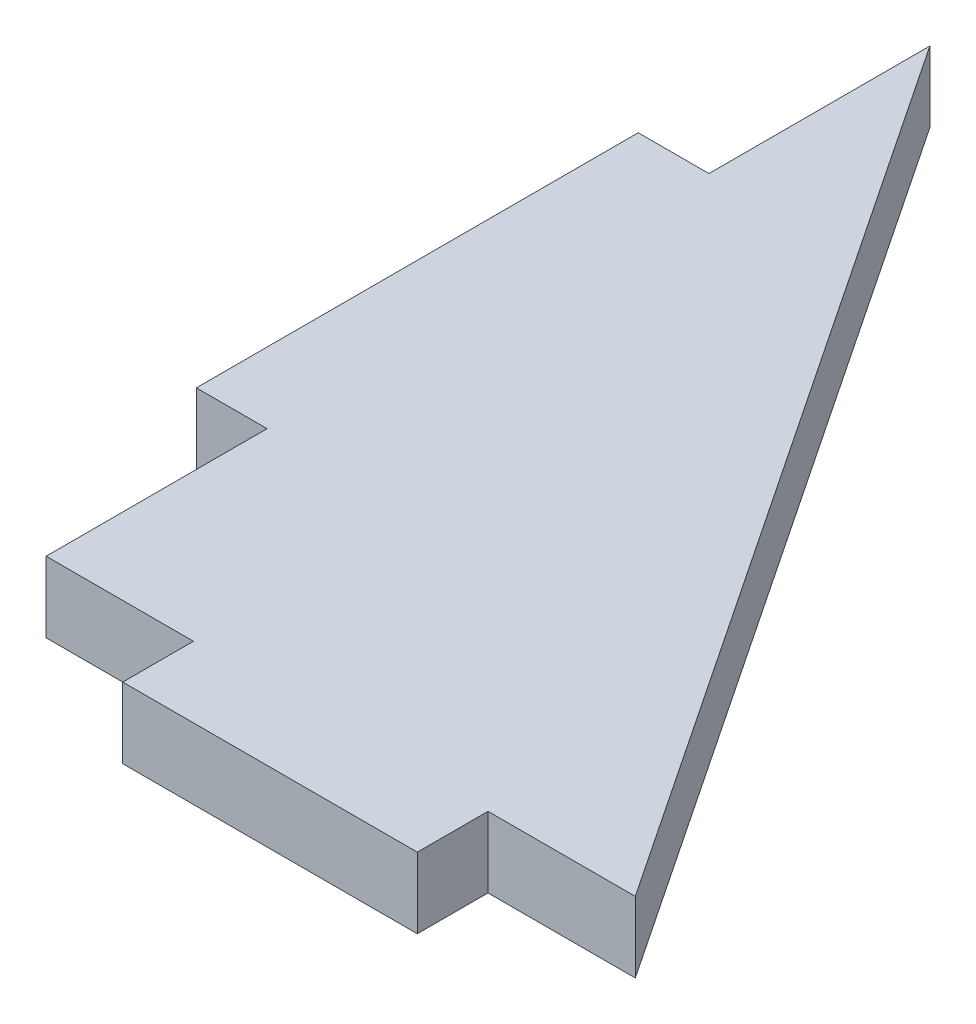
ISO-10303-21;
HEADER;
FILE_DESCRIPTION(('STEP AP214'),'2;1');
FILE_NAME('part.step','',(''),(''),'','','');
FILE_SCHEMA(('AUTOMOTIVE_DESIGN { 1 0 10303 214 1 1 1 1 }'));
ENDSEC;
DATA;
#1=APPLICATION_CONTEXT('core data for automotive mechanical design processes');
#2=APPLICATION_PROTOCOL_DEFINITION('international standard','automotive_design',2000,#1);
#3=PRODUCT_CONTEXT('',#1,'mechanical');
#4=PRODUCT('Part','Part','',(#3));
#5=PRODUCT_RELATED_PRODUCT_CATEGORY('part','',(#4));
#6=PRODUCT_DEFINITION_FORMATION('','',#4);
#7=PRODUCT_DEFINITION_CONTEXT('part definition',#1,'design');
#8=PRODUCT_DEFINITION('design','',#6,#7);
#9=PRODUCT_DEFINITION_SHAPE('','',#8);
#10=(LENGTH_UNIT() NAMED_UNIT(*) SI_UNIT(.MILLI.,.METRE.));
#11=(NAMED_UNIT(*) PLANE_ANGLE_UNIT() SI_UNIT($,.RADIAN.));
#12=(NAMED_UNIT(*) SI_UNIT($,.STERADIAN.) SOLID_ANGLE_UNIT());
#13=UNCERTAINTY_MEASURE_WITH_UNIT(LENGTH_MEASURE(1.E-05),#10,'distance_accuracy_value','');
#14=(GEOMETRIC_REPRESENTATION_CONTEXT(3) GLOBAL_UNCERTAINTY_ASSIGNED_CONTEXT((#13)) GLOBAL_UNIT_ASSIGNED_CONTEXT((#10,
#11,#12)) REPRESENTATION_CONTEXT('',''));
#15=CARTESIAN_POINT('',(0.,0.,0.));
#16=DIRECTION('',(0.,0.,1.));
#17=DIRECTION('',(1.,0.,0.));
#18=AXIS2_PLACEMENT_3D('',#15,#16,#17);
#19=CARTESIAN_POINT('',(0.,12.,0.));
#20=DIRECTION('',(0.,0.,-1.));
#21=DIRECTION('',(-1.,0.,0.));
#22=AXIS2_PLACEMENT_3D('',#19,#20,#21);
#23=PLANE('',#22);
#24=DIRECTION('',(1.,0.,0.));
#25=VECTOR('',#24,1.);
#26=CARTESIAN_POINT('',(0.,0.,0.));
#27=LINE('',#26,#25);
#28=CARTESIAN_POINT('',(0.,0.,0.));
#29=VERTEX_POINT('',#28);
#30=CARTESIAN_POINT('',(25.,0.,0.));
#31=VERTEX_POINT('',#30);
#32=EDGE_CURVE('E165',#29,#31,#27,.T.);
#33=ORIENTED_EDGE('',*,*,#32,.T.);
#34=DIRECTION('',(0.,-1.,0.));
#35=VECTOR('',#34,1.);
#36=CARTESIAN_POINT('',(25.,12.,0.));
#37=LINE('',#36,#35);
#38=CARTESIAN_POINT('',(25.,12.,0.));
#39=VERTEX_POINT('',#38);
#40=EDGE_CURVE('E11',#39,#31,#37,.T.);
#41=ORIENTED_EDGE('',*,*,#40,.F.);
#42=DIRECTION('',(1.,0.,0.));
#43=VECTOR('',#42,1.);
#44=CARTESIAN_POINT('',(0.,12.,0.));
#45=LINE('',#44,#43);
#46=CARTESIAN_POINT('',(0.,12.,0.));
#47=VERTEX_POINT('',#46);
#48=EDGE_CURVE('E244',#47,#39,#45,.T.);
#49=ORIENTED_EDGE('',*,*,#48,.F.);
#50=DIRECTION('',(0.,-1.,0.));
#51=VECTOR('',#50,1.);
#52=CARTESIAN_POINT('',(0.,12.,0.));
#53=LINE('',#52,#51);
#54=EDGE_CURVE('E61',#47,#29,#53,.T.);
#55=ORIENTED_EDGE('',*,*,#54,.T.);
#56=EDGE_LOOP('',(#33,#41,#49,#55));
#57=FACE_BOUND('',#56,.T.);
#58=ADVANCED_FACE('F43',(#57),#23,.F.);
#59=CARTESIAN_POINT('',(25.,12.,0.));
#60=DIRECTION('',(1.,0.,0.));
#61=DIRECTION('',(0.,0.,-1.));
#62=AXIS2_PLACEMENT_3D('',#59,#60,#61);
#63=PLANE('',#62);
#64=DIRECTION('',(0.,0.,1.));
#65=VECTOR('',#64,1.);
#66=CARTESIAN_POINT('',(25.,0.,0.));
#67=LINE('',#66,#65);
#68=CARTESIAN_POINT('',(25.,0.,12.));
#69=VERTEX_POINT('',#68);
#70=EDGE_CURVE('E168',#31,#69,#67,.T.);
#71=ORIENTED_EDGE('',*,*,#70,.T.);
#72=DIRECTION('',(0.,-1.,0.));
#73=VECTOR('',#72,1.);
#74=CARTESIAN_POINT('',(25.,12.,12.));
#75=LINE('',#74,#73);
#76=CARTESIAN_POINT('',(25.,12.,12.));
#77=VERTEX_POINT('',#76);
#78=EDGE_CURVE('E53',#77,#69,#75,.T.);
#79=ORIENTED_EDGE('',*,*,#78,.F.);
#80=DIRECTION('',(0.,0.,1.));
#81=VECTOR('',#80,1.);
#82=CARTESIAN_POINT('',(25.,12.,0.));
#83=LINE('',#82,#81);
#84=EDGE_CURVE('E109',#39,#77,#83,.T.);
#85=ORIENTED_EDGE('',*,*,#84,.F.);
#86=ORIENTED_EDGE('',*,*,#40,.T.);
#87=EDGE_LOOP('',(#71,#79,#85,#86));
#88=FACE_BOUND('',#87,.T.);
#89=ADVANCED_FACE('F45',(#88),#63,.F.);
#90=CARTESIAN_POINT('',(0.,12.,12.));
#91=DIRECTION('',(0.,0.,-1.));
#92=DIRECTION('',(-1.,0.,0.));
#93=AXIS2_PLACEMENT_3D('',#90,#91,#92);
#94=PLANE('',#93);
#95=DIRECTION('',(1.,0.,0.));
#96=VECTOR('',#95,1.);
#97=CARTESIAN_POINT('',(0.,0.,12.));
#98=LINE('',#97,#96);
#99=CARTESIAN_POINT('',(75.,0.,12.));
#100=VERTEX_POINT('',#99);
#101=EDGE_CURVE('E172',#69,#100,#98,.T.);
#102=ORIENTED_EDGE('',*,*,#101,.T.);
#103=DIRECTION('',(0.,-1.,0.));
#104=VECTOR('',#103,1.);
#105=CARTESIAN_POINT('',(75.,12.,12.));
#106=LINE('',#105,#104);
#107=CARTESIAN_POINT('',(75.,12.,12.));
#108=VERTEX_POINT('',#107);
#109=EDGE_CURVE('E216',#108,#100,#106,.T.);
#110=ORIENTED_EDGE('',*,*,#109,.F.);
#111=DIRECTION('',(1.,0.,0.));
#112=VECTOR('',#111,1.);
#113=CARTESIAN_POINT('',(0.,12.,12.));
#114=LINE('',#113,#112);
#115=EDGE_CURVE('E225',#77,#108,#114,.T.);
#116=ORIENTED_EDGE('',*,*,#115,.F.);
#117=ORIENTED_EDGE('',*,*,#78,.T.);
#118=EDGE_LOOP('',(#102,#110,#116,#117));
#119=FACE_BOUND('',#118,.T.);
#120=ADVANCED_FACE('F223',(#119),#94,.F.);
#121=CARTESIAN_POINT('',(75.,12.,0.));
#122=DIRECTION('',(1.,0.,0.));
#123=DIRECTION('',(0.,0.,-1.));
#124=AXIS2_PLACEMENT_3D('',#121,#122,#123);
#125=PLANE('',#124);
#126=DIRECTION('',(0.,0.,1.));
#127=VECTOR('',#126,1.);
#128=CARTESIAN_POINT('',(75.,0.,0.));
#129=LINE('',#128,#127);
#130=CARTESIAN_POINT('',(75.,0.,0.));
#131=VERTEX_POINT('',#130);
#132=EDGE_CURVE('E176',#131,#100,#129,.T.);
#133=ORIENTED_EDGE('',*,*,#132,.F.);
#134=DIRECTION('',(0.,-1.,0.));
#135=VECTOR('',#134,1.);
#136=CARTESIAN_POINT('',(75.,12.,0.));
#137=LINE('',#136,#135);
#138=CARTESIAN_POINT('',(75.,12.,0.));
#139=VERTEX_POINT('',#138);
#140=EDGE_CURVE('E213',#139,#131,#137,.T.);
#141=ORIENTED_EDGE('',*,*,#140,.F.);
#142=DIRECTION('',(0.,0.,1.));
#143=VECTOR('',#142,1.);
#144=CARTESIAN_POINT('',(75.,12.,0.));
#145=LINE('',#144,#143);
#146=EDGE_CURVE('E236',#139,#108,#145,.T.);
#147=ORIENTED_EDGE('',*,*,#146,.T.);
#148=ORIENTED_EDGE('',*,*,#109,.T.);
#149=EDGE_LOOP('',(#133,#141,#147,#148));
#150=FACE_BOUND('',#149,.T.);
#151=ADVANCED_FACE('F232',(#150),#125,.T.);
#152=CARTESIAN_POINT('',(100.,0.,0.));
#153=VERTEX_POINT('',#152);
#154=EDGE_CURVE('E169',#131,#153,#27,.T.);
#155=ORIENTED_EDGE('',*,*,#154,.T.);
#156=DIRECTION('',(0.,-1.,0.));
#157=VECTOR('',#156,1.);
#158=CARTESIAN_POINT('',(100.,12.,0.));
#159=LINE('',#158,#157);
#160=CARTESIAN_POINT('',(100.,12.,0.));
#161=VERTEX_POINT('',#160);
#162=EDGE_CURVE('E210',#161,#153,#159,.T.);
#163=ORIENTED_EDGE('',*,*,#162,.F.);
#164=EDGE_CURVE('E238',#139,#161,#45,.T.);
#165=ORIENTED_EDGE('',*,*,#164,.F.);
#166=ORIENTED_EDGE('',*,*,#140,.T.);
#167=EDGE_LOOP('',(#155,#163,#165,#166));
#168=FACE_BOUND('',#167,.T.);
#169=ADVANCED_FACE('F268',(#168),#23,.F.);
#170=CARTESIAN_POINT('',(69.2307692307692,12.,-46.1538461538462));
#171=DIRECTION('',(0.832050294337844,0.,-0.554700196225229));
#172=DIRECTION('',(-0.554700196225229,0.,-0.832050294337844));
#173=AXIS2_PLACEMENT_3D('',#170,#171,#172);
#174=PLANE('',#173);
#175=DIRECTION('',(0.554700196225229,0.,0.832050294337844));
#176=VECTOR('',#175,1.);
#177=CARTESIAN_POINT('',(69.2307692307692,0.,-46.1538461538462));
#178=LINE('',#177,#176);
#179=CARTESIAN_POINT('',(0.,0.,-150.));
#180=VERTEX_POINT('',#179);
#181=EDGE_CURVE('E180',#180,#153,#178,.T.);
#182=ORIENTED_EDGE('',*,*,#181,.F.);
#183=DIRECTION('',(0.,-1.,0.));
#184=VECTOR('',#183,1.);
#185=CARTESIAN_POINT('',(0.,12.,-150.));
#186=LINE('',#185,#184);
#187=CARTESIAN_POINT('',(0.,12.,-150.));
#188=VERTEX_POINT('',#187);
#189=EDGE_CURVE('E207',#188,#180,#186,.T.);
#190=ORIENTED_EDGE('',*,*,#189,.F.);
#191=DIRECTION('',(0.554700196225229,0.,0.832050294337844));
#192=VECTOR('',#191,1.);
#193=CARTESIAN_POINT('',(69.2307692307692,12.,-46.1538461538462));
#194=LINE('',#193,#192);
#195=EDGE_CURVE('E242',#188,#161,#194,.T.);
#196=ORIENTED_EDGE('',*,*,#195,.T.);
#197=ORIENTED_EDGE('',*,*,#162,.T.);
#198=EDGE_LOOP('',(#182,#190,#196,#197));
#199=FACE_BOUND('',#198,.T.);
#200=ADVANCED_FACE('F274',(#199),#174,.T.);
#201=CARTESIAN_POINT('',(0.,12.,0.));
#202=DIRECTION('',(-1.,0.,0.));
#203=DIRECTION('',(0.,0.,1.));
#204=AXIS2_PLACEMENT_3D('',#201,#202,#203);
#205=PLANE('',#204);
#206=DIRECTION('',(0.,0.,-1.));
#207=VECTOR('',#206,1.);
#208=CARTESIAN_POINT('',(0.,0.,0.));
#209=LINE('',#208,#207);
#210=CARTESIAN_POINT('',(0.,0.,-112.5));
#211=VERTEX_POINT('',#210);
#212=EDGE_CURVE('E184',#211,#180,#209,.T.);
#213=ORIENTED_EDGE('',*,*,#212,.F.);
#214=DIRECTION('',(0.,-1.,0.));
#215=VECTOR('',#214,1.);
#216=CARTESIAN_POINT('',(0.,12.,-112.5));
#217=LINE('',#216,#215);
#218=CARTESIAN_POINT('',(0.,12.,-112.5));
#219=VERTEX_POINT('',#218);
#220=EDGE_CURVE('E204',#219,#211,#217,.T.);
#221=ORIENTED_EDGE('',*,*,#220,.F.);
#222=DIRECTION('',(0.,0.,-1.));
#223=VECTOR('',#222,1.);
#224=CARTESIAN_POINT('',(0.,12.,0.));
#225=LINE('',#224,#223);
#226=EDGE_CURVE('E162',#219,#188,#225,.T.);
#227=ORIENTED_EDGE('',*,*,#226,.T.);
#228=ORIENTED_EDGE('',*,*,#189,.T.);
#229=EDGE_LOOP('',(#213,#221,#227,#228));
#230=FACE_BOUND('',#229,.T.);
#231=ADVANCED_FACE('F280',(#230),#205,.T.);
#232=CARTESIAN_POINT('',(0.,12.,-112.5));
#233=DIRECTION('',(0.,0.,-1.));
#234=DIRECTION('',(-1.,0.,0.));
#235=AXIS2_PLACEMENT_3D('',#232,#233,#234);
#236=PLANE('',#235);
#237=DIRECTION('',(1.,0.,0.));
#238=VECTOR('',#237,1.);
#239=CARTESIAN_POINT('',(0.,0.,-112.5));
#240=LINE('',#239,#238);
#241=CARTESIAN_POINT('',(-12.,0.,-112.5));
#242=VERTEX_POINT('',#241);
#243=EDGE_CURVE('E188',#242,#211,#240,.T.);
#244=ORIENTED_EDGE('',*,*,#243,.F.);
#245=DIRECTION('',(0.,-1.,0.));
#246=VECTOR('',#245,1.);
#247=CARTESIAN_POINT('',(-12.,12.,-112.5));
#248=LINE('',#247,#246);
#249=CARTESIAN_POINT('',(-12.,12.,-112.5));
#250=VERTEX_POINT('',#249);
#251=EDGE_CURVE('E154',#250,#242,#248,.T.);
#252=ORIENTED_EDGE('',*,*,#251,.F.);
#253=DIRECTION('',(1.,0.,0.));
#254=VECTOR('',#253,1.);
#255=CARTESIAN_POINT('',(0.,12.,-112.5));
#256=LINE('',#255,#254);
#257=EDGE_CURVE('E142',#250,#219,#256,.T.);
#258=ORIENTED_EDGE('',*,*,#257,.T.);
#259=ORIENTED_EDGE('',*,*,#220,.T.);
#260=EDGE_LOOP('',(#244,#252,#258,#259));
#261=FACE_BOUND('',#260,.T.);
#262=ADVANCED_FACE('F255',(#261),#236,.T.);
#263=CARTESIAN_POINT('',(-12.,12.,0.));
#264=DIRECTION('',(1.,0.,0.));
#265=DIRECTION('',(0.,0.,-1.));
#266=AXIS2_PLACEMENT_3D('',#263,#264,#265);
#267=PLANE('',#266);
#268=DIRECTION('',(0.,0.,1.));
#269=VECTOR('',#268,1.);
#270=CARTESIAN_POINT('',(-12.,0.,0.));
#271=LINE('',#270,#269);
#272=CARTESIAN_POINT('',(-12.,0.,-37.5));
#273=VERTEX_POINT('',#272);
#274=EDGE_CURVE('E150',#242,#273,#271,.T.);
#275=ORIENTED_EDGE('',*,*,#274,.T.);
#276=DIRECTION('',(0.,-1.,0.));
#277=VECTOR('',#276,1.);
#278=CARTESIAN_POINT('',(-12.,12.,-37.5));
#279=LINE('',#278,#277);
#280=CARTESIAN_POINT('',(-12.,12.,-37.5));
#281=VERTEX_POINT('',#280);
#282=EDGE_CURVE('E147',#281,#273,#279,.T.);
#283=ORIENTED_EDGE('',*,*,#282,.F.);
#284=DIRECTION('',(0.,0.,1.));
#285=VECTOR('',#284,1.);
#286=CARTESIAN_POINT('',(-12.,12.,0.));
#287=LINE('',#286,#285);
#288=EDGE_CURVE('E134',#250,#281,#287,.T.);
#289=ORIENTED_EDGE('',*,*,#288,.F.);
#290=ORIENTED_EDGE('',*,*,#251,.T.);
#291=EDGE_LOOP('',(#275,#283,#289,#290));
#292=FACE_BOUND('',#291,.T.);
#293=ADVANCED_FACE('F148',(#292),#267,.F.);
#294=CARTESIAN_POINT('',(0.,12.,-37.5));
#295=DIRECTION('',(0.,0.,-1.));
#296=DIRECTION('',(-1.,0.,0.));
#297=AXIS2_PLACEMENT_3D('',#294,#295,#296);
#298=PLANE('',#297);
#299=DIRECTION('',(1.,0.,0.));
#300=VECTOR('',#299,1.);
#301=CARTESIAN_POINT('',(0.,0.,-37.5));
#302=LINE('',#301,#300);
#303=CARTESIAN_POINT('',(0.,0.,-37.5));
#304=VERTEX_POINT('',#303);
#305=EDGE_CURVE('E195',#273,#304,#302,.T.);
#306=ORIENTED_EDGE('',*,*,#305,.T.);
#307=DIRECTION('',(0.,-1.,0.));
#308=VECTOR('',#307,1.);
#309=CARTESIAN_POINT('',(0.,12.,-37.5));
#310=LINE('',#309,#308);
#311=CARTESIAN_POINT('',(0.,12.,-37.5));
#312=VERTEX_POINT('',#311);
#313=EDGE_CURVE('E97',#312,#304,#310,.T.);
#314=ORIENTED_EDGE('',*,*,#313,.F.);
#315=DIRECTION('',(1.,0.,0.));
#316=VECTOR('',#315,1.);
#317=CARTESIAN_POINT('',(0.,12.,-37.5));
#318=LINE('',#317,#316);
#319=EDGE_CURVE('E139',#281,#312,#318,.T.);
#320=ORIENTED_EDGE('',*,*,#319,.F.);
#321=ORIENTED_EDGE('',*,*,#282,.T.);
#322=EDGE_LOOP('',(#306,#314,#320,#321));
#323=FACE_BOUND('',#322,.T.);
#324=ADVANCED_FACE('F156',(#323),#298,.F.);
#325=EDGE_CURVE('E189',#29,#304,#209,.T.);
#326=ORIENTED_EDGE('',*,*,#325,.F.);
#327=ORIENTED_EDGE('',*,*,#54,.F.);
#328=EDGE_CURVE('E158',#47,#312,#225,.T.);
#329=ORIENTED_EDGE('',*,*,#328,.T.);
#330=ORIENTED_EDGE('',*,*,#313,.T.);
#331=EDGE_LOOP('',(#326,#327,#329,#330));
#332=FACE_BOUND('',#331,.T.);
#333=ADVANCED_FACE('F289',(#332),#205,.T.);
#334=CARTESIAN_POINT('',(0.,12.,0.));
#335=DIRECTION('',(0.,1.,0.));
#336=DIRECTION('',(0.,0.,1.));
#337=AXIS2_PLACEMENT_3D('',#334,#335,#336);
#338=PLANE('',#337);
#339=ORIENTED_EDGE('',*,*,#48,.T.);
#340=ORIENTED_EDGE('',*,*,#84,.T.);
#341=ORIENTED_EDGE('',*,*,#115,.T.);
#342=ORIENTED_EDGE('',*,*,#146,.F.);
#343=ORIENTED_EDGE('',*,*,#164,.T.);
#344=ORIENTED_EDGE('',*,*,#195,.F.);
#345=ORIENTED_EDGE('',*,*,#226,.F.);
#346=ORIENTED_EDGE('',*,*,#257,.F.);
#347=ORIENTED_EDGE('',*,*,#288,.T.);
#348=ORIENTED_EDGE('',*,*,#319,.T.);
#349=ORIENTED_EDGE('',*,*,#328,.F.);
#350=EDGE_LOOP('',(#339,#340,#341,#342,#343,#344,#345,#346,#347,#348,#349));
#351=FACE_BOUND('',#350,.T.);
#352=ADVANCED_FACE('F136',(#351),#338,.T.);
#353=CARTESIAN_POINT('',(0.,0.,0.));
#354=DIRECTION('',(0.,1.,0.));
#355=DIRECTION('',(0.,0.,1.));
#356=AXIS2_PLACEMENT_3D('',#353,#354,#355);
#357=PLANE('',#356);
#358=ORIENTED_EDGE('',*,*,#32,.F.);
#359=ORIENTED_EDGE('',*,*,#325,.T.);
#360=ORIENTED_EDGE('',*,*,#305,.F.);
#361=ORIENTED_EDGE('',*,*,#274,.F.);
#362=ORIENTED_EDGE('',*,*,#243,.T.);
#363=ORIENTED_EDGE('',*,*,#212,.T.);
#364=ORIENTED_EDGE('',*,*,#181,.T.);
#365=ORIENTED_EDGE('',*,*,#154,.F.);
#366=ORIENTED_EDGE('',*,*,#132,.T.);
#367=ORIENTED_EDGE('',*,*,#101,.F.);
#368=ORIENTED_EDGE('',*,*,#70,.F.);
#369=EDGE_LOOP('',(#358,#359,#360,#361,#362,#363,#364,#365,#366,#367,#368));
#370=FACE_BOUND('',#369,.T.);
#371=ADVANCED_FACE('F227',(#370),#357,.F.);
#372=CLOSED_SHELL('',(#58,#89,#120,#151,#169,#200,#231,#262,#293,#324,#333,#352,#371));
#373=MANIFOLD_SOLID_BREP('B2',#372);
#374=ADVANCED_BREP_SHAPE_REPRESENTATION('',(#18,#373),#14);
#375=SHAPE_DEFINITION_REPRESENTATION(#9,#374);
ENDSEC;
END-ISO-10303-21;
